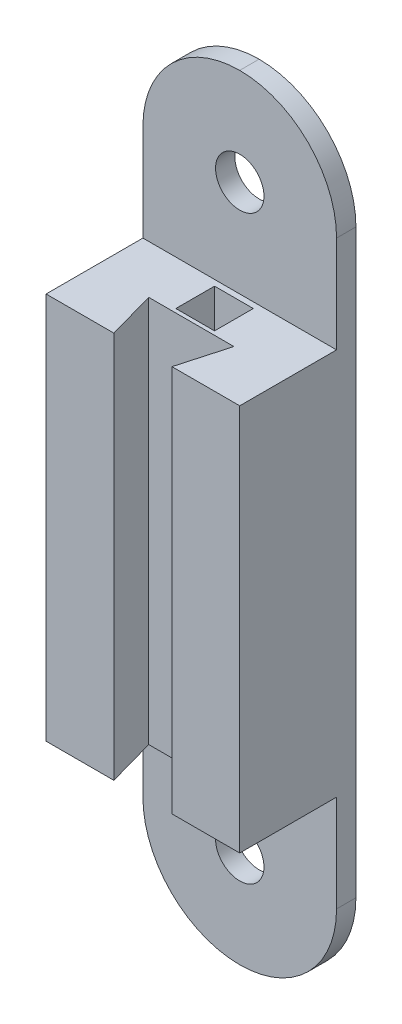
ISO-10303-21;
HEADER;
FILE_DESCRIPTION(('STEP AP214'),'2;1');
FILE_NAME('part.step','',(''),(''),'','','');
FILE_SCHEMA(('AUTOMOTIVE_DESIGN { 1 0 10303 214 1 1 1 1 }'));
ENDSEC;
DATA;
#1=APPLICATION_CONTEXT('core data for automotive mechanical design processes');
#2=APPLICATION_PROTOCOL_DEFINITION('international standard','automotive_design',2000,#1);
#3=PRODUCT_CONTEXT('',#1,'mechanical');
#4=PRODUCT('Part','Part','',(#3));
#5=PRODUCT_RELATED_PRODUCT_CATEGORY('part','',(#4));
#6=PRODUCT_DEFINITION_FORMATION('','',#4);
#7=PRODUCT_DEFINITION_CONTEXT('part definition',#1,'design');
#8=PRODUCT_DEFINITION('design','',#6,#7);
#9=PRODUCT_DEFINITION_SHAPE('','',#8);
#10=(LENGTH_UNIT() NAMED_UNIT(*) SI_UNIT(.MILLI.,.METRE.));
#11=(NAMED_UNIT(*) PLANE_ANGLE_UNIT() SI_UNIT($,.RADIAN.));
#12=(NAMED_UNIT(*) SI_UNIT($,.STERADIAN.) SOLID_ANGLE_UNIT());
#13=UNCERTAINTY_MEASURE_WITH_UNIT(LENGTH_MEASURE(1.E-05),#10,'distance_accuracy_value','');
#14=(GEOMETRIC_REPRESENTATION_CONTEXT(3) GLOBAL_UNCERTAINTY_ASSIGNED_CONTEXT((#13)) GLOBAL_UNIT_ASSIGNED_CONTEXT((#10,
#11,#12)) REPRESENTATION_CONTEXT('',''));
#15=CARTESIAN_POINT('',(0.,0.,0.));
#16=DIRECTION('',(0.,0.,1.));
#17=DIRECTION('',(1.,0.,0.));
#18=AXIS2_PLACEMENT_3D('',#15,#16,#17);
#19=CARTESIAN_POINT('',(0.,-12.7,15.24));
#20=DIRECTION('',(0.,1.,0.));
#21=DIRECTION('',(-1.,0.,0.));
#22=AXIS2_PLACEMENT_3D('',#19,#20,#21);
#23=PLANE('',#22);
#24=DIRECTION('',(-0.269629925519971,0.,0.962964019714182));
#25=VECTOR('',#24,1.);
#26=CARTESIAN_POINT('',(3.5330118694362,-12.7,16.2292433234421));
#27=LINE('',#26,#25);
#28=CARTESIAN_POINT('',(5.588,-12.7,8.89));
#29=VERTEX_POINT('',#28);
#30=CARTESIAN_POINT('',(3.81,-12.7,15.24));
#31=VERTEX_POINT('',#30);
#32=EDGE_CURVE('E241',#29,#31,#27,.T.);
#33=ORIENTED_EDGE('',*,*,#32,.F.);
#34=DIRECTION('',(1.,0.,0.));
#35=VECTOR('',#34,1.);
#36=CARTESIAN_POINT('',(0.,-12.7,8.89));
#37=LINE('',#36,#35);
#38=CARTESIAN_POINT('',(-5.588,-12.7,8.89));
#39=VERTEX_POINT('',#38);
#40=EDGE_CURVE('E244',#39,#29,#37,.T.);
#41=ORIENTED_EDGE('',*,*,#40,.F.);
#42=DIRECTION('',(-0.269629925519971,0.,-0.962964019714182));
#43=VECTOR('',#42,1.);
#44=CARTESIAN_POINT('',(-3.5330118694362,-12.7,16.2292433234421));
#45=LINE('',#44,#43);
#46=CARTESIAN_POINT('',(-3.81,-12.7,15.24));
#47=VERTEX_POINT('',#46);
#48=EDGE_CURVE('E236',#47,#39,#45,.T.);
#49=ORIENTED_EDGE('',*,*,#48,.F.);
#50=DIRECTION('',(1.,0.,0.));
#51=VECTOR('',#50,1.);
#52=CARTESIAN_POINT('',(0.,-12.7,15.24));
#53=LINE('',#52,#51);
#54=CARTESIAN_POINT('',(-12.7,-12.7,15.24));
#55=VERTEX_POINT('',#54);
#56=EDGE_CURVE('E252',#55,#47,#53,.T.);
#57=ORIENTED_EDGE('',*,*,#56,.F.);
#58=DIRECTION('',(0.,0.,-1.));
#59=VECTOR('',#58,1.);
#60=CARTESIAN_POINT('',(-12.7,-12.7,15.24));
#61=LINE('',#60,#59);
#62=CARTESIAN_POINT('',(-12.7,-12.7,2.54));
#63=VERTEX_POINT('',#62);
#64=EDGE_CURVE('E277',#55,#63,#61,.T.);
#65=ORIENTED_EDGE('',*,*,#64,.T.);
#66=DIRECTION('',(-1.,0.,0.));
#67=VECTOR('',#66,1.);
#68=CARTESIAN_POINT('',(0.,-12.7,2.54));
#69=LINE('',#68,#67);
#70=CARTESIAN_POINT('',(12.7,-12.7,2.54));
#71=VERTEX_POINT('',#70);
#72=EDGE_CURVE('E285',#71,#63,#69,.T.);
#73=ORIENTED_EDGE('',*,*,#72,.F.);
#74=DIRECTION('',(0.,0.,-1.));
#75=VECTOR('',#74,1.);
#76=CARTESIAN_POINT('',(12.7,-12.7,15.24));
#77=LINE('',#76,#75);
#78=CARTESIAN_POINT('',(12.7,-12.7,15.24));
#79=VERTEX_POINT('',#78);
#80=EDGE_CURVE('E273',#79,#71,#77,.T.);
#81=ORIENTED_EDGE('',*,*,#80,.F.);
#82=EDGE_CURVE('E251',#31,#79,#53,.T.);
#83=ORIENTED_EDGE('',*,*,#82,.F.);
#84=EDGE_LOOP('',(#33,#41,#49,#57,#65,#73,#81,#83));
#85=FACE_BOUND('',#84,.T.);
#86=ADVANCED_FACE('F43',(#85),#23,.F.);
#87=CARTESIAN_POINT('',(0.,38.1,15.24));
#88=DIRECTION('',(0.,1.,0.));
#89=DIRECTION('',(0.,0.,1.));
#90=AXIS2_PLACEMENT_3D('',#87,#88,#89);
#91=PLANE('',#90);
#92=DIRECTION('',(0.,0.,-1.));
#93=VECTOR('',#92,1.);
#94=CARTESIAN_POINT('',(2.53999999999997,38.1,3.302));
#95=LINE('',#94,#93);
#96=CARTESIAN_POINT('',(2.53999999999997,38.1,8.382));
#97=VERTEX_POINT('',#96);
#98=CARTESIAN_POINT('',(2.53999999999997,38.1,3.302));
#99=VERTEX_POINT('',#98);
#100=EDGE_CURVE('E61',#97,#99,#95,.T.);
#101=ORIENTED_EDGE('',*,*,#100,.F.);
#102=DIRECTION('',(1.,0.,0.));
#103=VECTOR('',#102,1.);
#104=CARTESIAN_POINT('',(-2.54000000000003,38.1,8.382));
#105=LINE('',#104,#103);
#106=CARTESIAN_POINT('',(-2.54000000000003,38.1,8.382));
#107=VERTEX_POINT('',#106);
#108=EDGE_CURVE('E192',#107,#97,#105,.T.);
#109=ORIENTED_EDGE('',*,*,#108,.F.);
#110=DIRECTION('',(0.,0.,1.));
#111=VECTOR('',#110,1.);
#112=CARTESIAN_POINT('',(-2.54000000000003,38.1,3.302));
#113=LINE('',#112,#111);
#114=CARTESIAN_POINT('',(-2.54000000000003,38.1,3.302));
#115=VERTEX_POINT('',#114);
#116=EDGE_CURVE('E196',#115,#107,#113,.T.);
#117=ORIENTED_EDGE('',*,*,#116,.F.);
#118=DIRECTION('',(-1.,0.,0.));
#119=VECTOR('',#118,1.);
#120=CARTESIAN_POINT('',(-2.54000000000003,38.1,3.302));
#121=LINE('',#120,#119);
#122=EDGE_CURVE('E205',#99,#115,#121,.T.);
#123=ORIENTED_EDGE('',*,*,#122,.F.);
#124=EDGE_LOOP('',(#101,#109,#117,#123));
#125=FACE_BOUND('',#124,.T.);
#126=DIRECTION('',(1.,0.,0.));
#127=VECTOR('',#126,1.);
#128=CARTESIAN_POINT('',(0.,38.1,8.89));
#129=LINE('',#128,#127);
#130=CARTESIAN_POINT('',(-5.588,38.1,8.89));
#131=VERTEX_POINT('',#130);
#132=CARTESIAN_POINT('',(5.588,38.1,8.89));
#133=VERTEX_POINT('',#132);
#134=EDGE_CURVE('E223',#131,#133,#129,.T.);
#135=ORIENTED_EDGE('',*,*,#134,.T.);
#136=DIRECTION('',(-0.269629925519971,0.,0.962964019714182));
#137=VECTOR('',#136,1.);
#138=CARTESIAN_POINT('',(7.48998516320475,38.1,2.09719584569733));
#139=LINE('',#138,#137);
#140=CARTESIAN_POINT('',(3.81,38.1,15.24));
#141=VERTEX_POINT('',#140);
#142=EDGE_CURVE('E219',#133,#141,#139,.T.);
#143=ORIENTED_EDGE('',*,*,#142,.T.);
#144=DIRECTION('',(1.,0.,0.));
#145=VECTOR('',#144,1.);
#146=CARTESIAN_POINT('',(0.,38.1,15.24));
#147=LINE('',#146,#145);
#148=CARTESIAN_POINT('',(12.7,38.1,15.24));
#149=VERTEX_POINT('',#148);
#150=EDGE_CURVE('E260',#141,#149,#147,.T.);
#151=ORIENTED_EDGE('',*,*,#150,.T.);
#152=DIRECTION('',(0.,0.,-1.));
#153=VECTOR('',#152,1.);
#154=CARTESIAN_POINT('',(12.7,38.1,15.24));
#155=LINE('',#154,#153);
#156=CARTESIAN_POINT('',(12.7,38.1,2.54));
#157=VERTEX_POINT('',#156);
#158=EDGE_CURVE('E269',#149,#157,#155,.T.);
#159=ORIENTED_EDGE('',*,*,#158,.T.);
#160=DIRECTION('',(-1.,0.,0.));
#161=VECTOR('',#160,1.);
#162=CARTESIAN_POINT('',(0.,38.1,2.54));
#163=LINE('',#162,#161);
#164=CARTESIAN_POINT('',(-12.7,38.1,2.54));
#165=VERTEX_POINT('',#164);
#166=EDGE_CURVE('E281',#157,#165,#163,.T.);
#167=ORIENTED_EDGE('',*,*,#166,.T.);
#168=DIRECTION('',(0.,0.,-1.));
#169=VECTOR('',#168,1.);
#170=CARTESIAN_POINT('',(-12.7,38.1,15.24));
#171=LINE('',#170,#169);
#172=CARTESIAN_POINT('',(-12.7,38.1,15.24));
#173=VERTEX_POINT('',#172);
#174=EDGE_CURVE('E265',#173,#165,#171,.T.);
#175=ORIENTED_EDGE('',*,*,#174,.F.);
#176=CARTESIAN_POINT('',(-3.81,38.1,15.24));
#177=VERTEX_POINT('',#176);
#178=EDGE_CURVE('E261',#173,#177,#147,.T.);
#179=ORIENTED_EDGE('',*,*,#178,.T.);
#180=DIRECTION('',(-0.269629925519971,0.,-0.962964019714182));
#181=VECTOR('',#180,1.);
#182=CARTESIAN_POINT('',(-7.48998516320475,38.1,2.09719584569733));
#183=LINE('',#182,#181);
#184=EDGE_CURVE('E228',#177,#131,#183,.T.);
#185=ORIENTED_EDGE('',*,*,#184,.T.);
#186=EDGE_LOOP('',(#135,#143,#151,#159,#167,#175,#179,#185));
#187=FACE_BOUND('',#186,.T.);
#188=ADVANCED_FACE('F387',(#125,#187),#91,.T.);
#189=CARTESIAN_POINT('',(0.,0.,15.24));
#190=DIRECTION('',(0.,0.,1.));
#191=DIRECTION('',(1.,0.,0.));
#192=AXIS2_PLACEMENT_3D('',#189,#190,#191);
#193=PLANE('',#192);
#194=ORIENTED_EDGE('',*,*,#150,.F.);
#195=DIRECTION('',(0.,-1.,0.));
#196=VECTOR('',#195,1.);
#197=CARTESIAN_POINT('',(3.81,0.,15.24));
#198=LINE('',#197,#196);
#199=EDGE_CURVE('E324',#141,#31,#198,.T.);
#200=ORIENTED_EDGE('',*,*,#199,.T.);
#201=ORIENTED_EDGE('',*,*,#82,.T.);
#202=DIRECTION('',(0.,-1.,0.));
#203=VECTOR('',#202,1.);
#204=CARTESIAN_POINT('',(12.7,0.,15.24));
#205=LINE('',#204,#203);
#206=EDGE_CURVE('E256',#149,#79,#205,.T.);
#207=ORIENTED_EDGE('',*,*,#206,.F.);
#208=EDGE_LOOP('',(#194,#200,#201,#207));
#209=FACE_BOUND('',#208,.T.);
#210=ADVANCED_FACE('F416',(#209),#193,.T.);
#211=ORIENTED_EDGE('',*,*,#56,.T.);
#212=DIRECTION('',(0.,1.,0.));
#213=VECTOR('',#212,1.);
#214=CARTESIAN_POINT('',(-3.81,0.,15.24));
#215=LINE('',#214,#213);
#216=EDGE_CURVE('E306',#47,#177,#215,.T.);
#217=ORIENTED_EDGE('',*,*,#216,.T.);
#218=ORIENTED_EDGE('',*,*,#178,.F.);
#219=DIRECTION('',(0.,-1.,0.));
#220=VECTOR('',#219,1.);
#221=CARTESIAN_POINT('',(-12.7,0.,15.24));
#222=LINE('',#221,#220);
#223=EDGE_CURVE('E247',#173,#55,#222,.T.);
#224=ORIENTED_EDGE('',*,*,#223,.T.);
#225=EDGE_LOOP('',(#211,#217,#218,#224));
#226=FACE_BOUND('',#225,.T.);
#227=ADVANCED_FACE('F612',(#226),#193,.T.);
#228=CARTESIAN_POINT('',(0.,0.,2.54));
#229=DIRECTION('',(0.,0.,1.));
#230=DIRECTION('',(1.,0.,0.));
#231=AXIS2_PLACEMENT_3D('',#228,#229,#230);
#232=PLANE('',#231);
#233=CARTESIAN_POINT('',(0.,-25.4,2.54));
#234=DIRECTION('',(0.,0.,1.));
#235=DIRECTION('',(1.,0.,0.));
#236=AXIS2_PLACEMENT_3D('',#233,#234,#235);
#237=CIRCLE('',#236,3.175);
#238=CARTESIAN_POINT('',(3.175,-25.4,2.54));
#239=VERTEX_POINT('',#238);
#240=EDGE_CURVE('E302',#239,#239,#237,.T.);
#241=ORIENTED_EDGE('',*,*,#240,.F.);
#242=EDGE_LOOP('',(#241));
#243=FACE_BOUND('',#242,.T.);
#244=CARTESIAN_POINT('',(0.,-25.4,2.54));
#245=DIRECTION('',(0.,0.,1.));
#246=DIRECTION('',(1.,0.,0.));
#247=AXIS2_PLACEMENT_3D('',#244,#245,#246);
#248=CIRCLE('',#247,12.7);
#249=CARTESIAN_POINT('',(-12.7,-25.4,2.54));
#250=VERTEX_POINT('',#249);
#251=CARTESIAN_POINT('',(0.,-38.1,2.54));
#252=VERTEX_POINT('',#251);
#253=EDGE_CURVE('E348',#250,#252,#248,.T.);
#254=ORIENTED_EDGE('',*,*,#253,.T.);
#255=CARTESIAN_POINT('',(0.,-25.4,2.54));
#256=DIRECTION('',(0.,0.,1.));
#257=DIRECTION('',(1.,0.,0.));
#258=AXIS2_PLACEMENT_3D('',#255,#256,#257);
#259=CIRCLE('',#258,12.7);
#260=CARTESIAN_POINT('',(12.7,-25.4,2.54));
#261=VERTEX_POINT('',#260);
#262=EDGE_CURVE('E351',#252,#261,#259,.T.);
#263=ORIENTED_EDGE('',*,*,#262,.T.);
#264=DIRECTION('',(0.,-1.,0.));
#265=VECTOR('',#264,1.);
#266=CARTESIAN_POINT('',(12.7,0.,2.54));
#267=LINE('',#266,#265);
#268=EDGE_CURVE('E293',#71,#261,#267,.T.);
#269=ORIENTED_EDGE('',*,*,#268,.F.);
#270=ORIENTED_EDGE('',*,*,#72,.T.);
#271=DIRECTION('',(0.,-1.,0.));
#272=VECTOR('',#271,1.);
#273=CARTESIAN_POINT('',(-12.7,0.,2.54));
#274=LINE('',#273,#272);
#275=EDGE_CURVE('E298',#63,#250,#274,.T.);
#276=ORIENTED_EDGE('',*,*,#275,.T.);
#277=EDGE_LOOP('',(#254,#263,#269,#270,#276));
#278=FACE_BOUND('',#277,.T.);
#279=ADVANCED_FACE('F406',(#243,#278),#232,.T.);
#280=CARTESIAN_POINT('',(12.7,0.,2.54));
#281=DIRECTION('',(1.,0.,0.));
#282=DIRECTION('',(0.,1.,0.));
#283=AXIS2_PLACEMENT_3D('',#280,#281,#282);
#284=PLANE('',#283);
#285=ORIENTED_EDGE('',*,*,#268,.T.);
#286=DIRECTION('',(0.,0.,-1.));
#287=VECTOR('',#286,1.);
#288=CARTESIAN_POINT('',(12.7,-25.4,0.));
#289=LINE('',#288,#287);
#290=CARTESIAN_POINT('',(12.7,-25.4,0.));
#291=VERTEX_POINT('',#290);
#292=EDGE_CURVE('E332',#261,#291,#289,.T.);
#293=ORIENTED_EDGE('',*,*,#292,.T.);
#294=DIRECTION('',(0.,-1.,0.));
#295=VECTOR('',#294,1.);
#296=CARTESIAN_POINT('',(12.7,0.,0.));
#297=LINE('',#296,#295);
#298=CARTESIAN_POINT('',(12.7,50.8,0.));
#299=VERTEX_POINT('',#298);
#300=EDGE_CURVE('E310',#299,#291,#297,.T.);
#301=ORIENTED_EDGE('',*,*,#300,.F.);
#302=DIRECTION('',(0.,0.,-1.));
#303=VECTOR('',#302,1.);
#304=CARTESIAN_POINT('',(12.7,50.8,2.54));
#305=LINE('',#304,#303);
#306=CARTESIAN_POINT('',(12.7,50.8,2.54));
#307=VERTEX_POINT('',#306);
#308=EDGE_CURVE('E328',#299,#307,#305,.F.);
#309=ORIENTED_EDGE('',*,*,#308,.T.);
#310=EDGE_CURVE('E295',#307,#157,#267,.T.);
#311=ORIENTED_EDGE('',*,*,#310,.T.);
#312=ORIENTED_EDGE('',*,*,#158,.F.);
#313=ORIENTED_EDGE('',*,*,#206,.T.);
#314=ORIENTED_EDGE('',*,*,#80,.T.);
#315=EDGE_LOOP('',(#285,#293,#301,#309,#311,#312,#313,#314));
#316=FACE_BOUND('',#315,.T.);
#317=ADVANCED_FACE('F391',(#316),#284,.T.);
#318=CARTESIAN_POINT('',(-12.7,0.,2.54));
#319=DIRECTION('',(1.,0.,0.));
#320=DIRECTION('',(0.,1.,0.));
#321=AXIS2_PLACEMENT_3D('',#318,#319,#320);
#322=PLANE('',#321);
#323=DIRECTION('',(0.,-1.,0.));
#324=VECTOR('',#323,1.);
#325=CARTESIAN_POINT('',(-12.7,0.,0.));
#326=LINE('',#325,#324);
#327=CARTESIAN_POINT('',(-12.7,50.8,0.));
#328=VERTEX_POINT('',#327);
#329=CARTESIAN_POINT('',(-12.7,-25.4,0.));
#330=VERTEX_POINT('',#329);
#331=EDGE_CURVE('E314',#328,#330,#326,.T.);
#332=ORIENTED_EDGE('',*,*,#331,.T.);
#333=DIRECTION('',(0.,0.,-1.));
#334=VECTOR('',#333,1.);
#335=CARTESIAN_POINT('',(-12.7,-25.4,2.54));
#336=LINE('',#335,#334);
#337=EDGE_CURVE('E357',#330,#250,#336,.F.);
#338=ORIENTED_EDGE('',*,*,#337,.T.);
#339=ORIENTED_EDGE('',*,*,#275,.F.);
#340=ORIENTED_EDGE('',*,*,#64,.F.);
#341=ORIENTED_EDGE('',*,*,#223,.F.);
#342=ORIENTED_EDGE('',*,*,#174,.T.);
#343=CARTESIAN_POINT('',(-12.7,50.8,2.54));
#344=VERTEX_POINT('',#343);
#345=EDGE_CURVE('E299',#344,#165,#274,.T.);
#346=ORIENTED_EDGE('',*,*,#345,.F.);
#347=DIRECTION('',(0.,0.,-1.));
#348=VECTOR('',#347,1.);
#349=CARTESIAN_POINT('',(-12.7,50.8,0.));
#350=LINE('',#349,#348);
#351=EDGE_CURVE('E354',#344,#328,#350,.T.);
#352=ORIENTED_EDGE('',*,*,#351,.T.);
#353=EDGE_LOOP('',(#332,#338,#339,#340,#341,#342,#346,#352));
#354=FACE_BOUND('',#353,.T.);
#355=ADVANCED_FACE('F381',(#354),#322,.F.);
#356=CARTESIAN_POINT('',(0.,50.8,2.54));
#357=DIRECTION('',(0.,0.,-1.));
#358=DIRECTION('',(-1.,0.,0.));
#359=AXIS2_PLACEMENT_3D('',#356,#357,#358);
#360=CYLINDRICAL_SURFACE('',#359,3.175);
#361=CARTESIAN_POINT('',(0.,50.8,2.54));
#362=DIRECTION('',(0.,0.,1.));
#363=DIRECTION('',(1.,0.,0.));
#364=AXIS2_PLACEMENT_3D('',#361,#362,#363);
#365=CIRCLE('',#364,3.175);
#366=CARTESIAN_POINT('',(3.175,50.8,2.54));
#367=VERTEX_POINT('',#366);
#368=EDGE_CURVE('E289',#367,#367,#365,.T.);
#369=ORIENTED_EDGE('',*,*,#368,.T.);
#370=EDGE_LOOP('',(#369));
#371=FACE_BOUND('',#370,.T.);
#372=CARTESIAN_POINT('',(0.,50.8,0.));
#373=DIRECTION('',(0.,0.,1.));
#374=DIRECTION('',(1.,0.,0.));
#375=AXIS2_PLACEMENT_3D('',#372,#373,#374);
#376=CIRCLE('',#375,3.175);
#377=CARTESIAN_POINT('',(3.175,50.8,0.));
#378=VERTEX_POINT('',#377);
#379=EDGE_CURVE('E288',#378,#378,#376,.T.);
#380=ORIENTED_EDGE('',*,*,#379,.F.);
#381=EDGE_LOOP('',(#380));
#382=FACE_BOUND('',#381,.T.);
#383=ADVANCED_FACE('F447',(#371,#382),#360,.F.);
#384=CARTESIAN_POINT('',(0.,-25.4,2.54));
#385=DIRECTION('',(0.,0.,-1.));
#386=DIRECTION('',(-1.,0.,0.));
#387=AXIS2_PLACEMENT_3D('',#384,#385,#386);
#388=CYLINDRICAL_SURFACE('',#387,3.175);
#389=ORIENTED_EDGE('',*,*,#240,.T.);
#390=EDGE_LOOP('',(#389));
#391=FACE_BOUND('',#390,.T.);
#392=CARTESIAN_POINT('',(0.,-25.4,0.));
#393=DIRECTION('',(0.,0.,1.));
#394=DIRECTION('',(1.,0.,0.));
#395=AXIS2_PLACEMENT_3D('',#392,#393,#394);
#396=CIRCLE('',#395,3.175);
#397=CARTESIAN_POINT('',(3.175,-25.4,0.));
#398=VERTEX_POINT('',#397);
#399=EDGE_CURVE('E294',#398,#398,#396,.T.);
#400=ORIENTED_EDGE('',*,*,#399,.F.);
#401=EDGE_LOOP('',(#400));
#402=FACE_BOUND('',#401,.T.);
#403=ADVANCED_FACE('F440',(#391,#402),#388,.F.);
#404=ORIENTED_EDGE('',*,*,#310,.F.);
#405=CARTESIAN_POINT('',(0.,50.8,2.54));
#406=DIRECTION('',(0.,0.,1.));
#407=DIRECTION('',(1.,0.,0.));
#408=AXIS2_PLACEMENT_3D('',#405,#406,#407);
#409=CIRCLE('',#408,12.7);
#410=CARTESIAN_POINT('',(0.,63.5,2.54));
#411=VERTEX_POINT('',#410);
#412=EDGE_CURVE('E11',#307,#411,#409,.T.);
#413=ORIENTED_EDGE('',*,*,#412,.T.);
#414=CARTESIAN_POINT('',(0.,50.8,2.54));
#415=DIRECTION('',(0.,0.,1.));
#416=DIRECTION('',(1.,0.,0.));
#417=AXIS2_PLACEMENT_3D('',#414,#415,#416);
#418=CIRCLE('',#417,12.7);
#419=EDGE_CURVE('E53',#411,#344,#418,.T.);
#420=ORIENTED_EDGE('',*,*,#419,.T.);
#421=ORIENTED_EDGE('',*,*,#345,.T.);
#422=ORIENTED_EDGE('',*,*,#166,.F.);
#423=EDGE_LOOP('',(#404,#413,#420,#421,#422));
#424=FACE_BOUND('',#423,.T.);
#425=ORIENTED_EDGE('',*,*,#368,.F.);
#426=EDGE_LOOP('',(#425));
#427=FACE_BOUND('',#426,.T.);
#428=ADVANCED_FACE('F377',(#424,#427),#232,.T.);
#429=CARTESIAN_POINT('',(0.,0.,0.));
#430=DIRECTION('',(0.,0.,1.));
#431=DIRECTION('',(1.,0.,0.));
#432=AXIS2_PLACEMENT_3D('',#429,#430,#431);
#433=PLANE('',#432);
#434=ORIENTED_EDGE('',*,*,#379,.T.);
#435=EDGE_LOOP('',(#434));
#436=FACE_BOUND('',#435,.T.);
#437=ORIENTED_EDGE('',*,*,#300,.T.);
#438=CARTESIAN_POINT('',(0.,-25.4,0.));
#439=DIRECTION('',(0.,0.,1.));
#440=DIRECTION('',(1.,0.,0.));
#441=AXIS2_PLACEMENT_3D('',#438,#439,#440);
#442=CIRCLE('',#441,12.7);
#443=CARTESIAN_POINT('',(0.,-38.1,0.));
#444=VERTEX_POINT('',#443);
#445=EDGE_CURVE('E345',#291,#444,#442,.F.);
#446=ORIENTED_EDGE('',*,*,#445,.T.);
#447=CARTESIAN_POINT('',(0.,-25.4,0.));
#448=DIRECTION('',(0.,0.,1.));
#449=DIRECTION('',(1.,0.,0.));
#450=AXIS2_PLACEMENT_3D('',#447,#448,#449);
#451=CIRCLE('',#450,12.7);
#452=EDGE_CURVE('E342',#444,#330,#451,.F.);
#453=ORIENTED_EDGE('',*,*,#452,.T.);
#454=ORIENTED_EDGE('',*,*,#331,.F.);
#455=CARTESIAN_POINT('',(0.,50.8,0.));
#456=DIRECTION('',(0.,0.,1.));
#457=DIRECTION('',(1.,0.,0.));
#458=AXIS2_PLACEMENT_3D('',#455,#456,#457);
#459=CIRCLE('',#458,12.7);
#460=CARTESIAN_POINT('',(0.,63.5,0.));
#461=VERTEX_POINT('',#460);
#462=EDGE_CURVE('E336',#328,#461,#459,.F.);
#463=ORIENTED_EDGE('',*,*,#462,.T.);
#464=CARTESIAN_POINT('',(0.,50.8,0.));
#465=DIRECTION('',(0.,0.,1.));
#466=DIRECTION('',(1.,0.,0.));
#467=AXIS2_PLACEMENT_3D('',#464,#465,#466);
#468=CIRCLE('',#467,12.7);
#469=EDGE_CURVE('E339',#461,#299,#468,.F.);
#470=ORIENTED_EDGE('',*,*,#469,.T.);
#471=EDGE_LOOP('',(#437,#446,#453,#454,#463,#470));
#472=FACE_BOUND('',#471,.T.);
#473=ORIENTED_EDGE('',*,*,#399,.T.);
#474=EDGE_LOOP('',(#473));
#475=FACE_BOUND('',#474,.T.);
#476=ADVANCED_FACE('F396',(#436,#472,#475),#433,.F.);
#477=CARTESIAN_POINT('',(0.,-38.1,8.89));
#478=DIRECTION('',(0.,0.,1.));
#479=DIRECTION('',(1.,0.,0.));
#480=AXIS2_PLACEMENT_3D('',#477,#478,#479);
#481=PLANE('',#480);
#482=ORIENTED_EDGE('',*,*,#40,.T.);
#483=DIRECTION('',(0.,1.,0.));
#484=VECTOR('',#483,1.);
#485=CARTESIAN_POINT('',(5.588,-38.1,8.89));
#486=LINE('',#485,#484);
#487=EDGE_CURVE('E232',#29,#133,#486,.T.);
#488=ORIENTED_EDGE('',*,*,#487,.T.);
#489=ORIENTED_EDGE('',*,*,#134,.F.);
#490=DIRECTION('',(0.,1.,0.));
#491=VECTOR('',#490,1.);
#492=CARTESIAN_POINT('',(-5.588,-38.1,8.89));
#493=LINE('',#492,#491);
#494=EDGE_CURVE('E233',#39,#131,#493,.T.);
#495=ORIENTED_EDGE('',*,*,#494,.F.);
#496=EDGE_LOOP('',(#482,#488,#489,#495));
#497=FACE_BOUND('',#496,.T.);
#498=ADVANCED_FACE('F443',(#497),#481,.T.);
#499=CARTESIAN_POINT('',(7.48998516320475,-38.1,2.09719584569733));
#500=DIRECTION('',(-0.962964019714182,0.,-0.269629925519971));
#501=DIRECTION('',(-0.269629925519971,0.,0.962964019714182));
#502=AXIS2_PLACEMENT_3D('',#499,#500,#501);
#503=PLANE('',#502);
#504=ORIENTED_EDGE('',*,*,#32,.T.);
#505=ORIENTED_EDGE('',*,*,#199,.F.);
#506=ORIENTED_EDGE('',*,*,#142,.F.);
#507=ORIENTED_EDGE('',*,*,#487,.F.);
#508=EDGE_LOOP('',(#504,#505,#506,#507));
#509=FACE_BOUND('',#508,.T.);
#510=ADVANCED_FACE('F480',(#509),#503,.T.);
#511=CARTESIAN_POINT('',(-7.48998516320475,-38.1,2.09719584569733));
#512=DIRECTION('',(0.962964019714182,0.,-0.269629925519971));
#513=DIRECTION('',(-0.269629925519971,0.,-0.962964019714182));
#514=AXIS2_PLACEMENT_3D('',#511,#512,#513);
#515=PLANE('',#514);
#516=ORIENTED_EDGE('',*,*,#48,.T.);
#517=ORIENTED_EDGE('',*,*,#494,.T.);
#518=ORIENTED_EDGE('',*,*,#184,.F.);
#519=ORIENTED_EDGE('',*,*,#216,.F.);
#520=EDGE_LOOP('',(#516,#517,#518,#519));
#521=FACE_BOUND('',#520,.T.);
#522=ADVANCED_FACE('F426',(#521),#515,.T.);
#523=CARTESIAN_POINT('',(0.,-25.4,2.54));
#524=DIRECTION('',(0.,0.,-1.));
#525=DIRECTION('',(-1.,0.,0.));
#526=AXIS2_PLACEMENT_3D('',#523,#524,#525);
#527=CYLINDRICAL_SURFACE('',#526,12.7);
#528=DIRECTION('',(0.,0.,-1.));
#529=VECTOR('',#528,1.);
#530=CARTESIAN_POINT('',(0.,-38.1,2.54));
#531=LINE('',#530,#529);
#532=EDGE_CURVE('E224',#252,#444,#531,.T.);
#533=ORIENTED_EDGE('',*,*,#532,.F.);
#534=ORIENTED_EDGE('',*,*,#253,.F.);
#535=ORIENTED_EDGE('',*,*,#337,.F.);
#536=ORIENTED_EDGE('',*,*,#452,.F.);
#537=EDGE_LOOP('',(#533,#534,#535,#536));
#538=FACE_BOUND('',#537,.T.);
#539=ADVANCED_FACE('F404',(#538),#527,.T.);
#540=CARTESIAN_POINT('',(0.,-25.4,2.54));
#541=DIRECTION('',(0.,0.,1.));
#542=DIRECTION('',(1.,0.,0.));
#543=AXIS2_PLACEMENT_3D('',#540,#541,#542);
#544=CYLINDRICAL_SURFACE('',#543,12.7);
#545=ORIENTED_EDGE('',*,*,#262,.F.);
#546=ORIENTED_EDGE('',*,*,#532,.T.);
#547=ORIENTED_EDGE('',*,*,#445,.F.);
#548=ORIENTED_EDGE('',*,*,#292,.F.);
#549=EDGE_LOOP('',(#545,#546,#547,#548));
#550=FACE_BOUND('',#549,.T.);
#551=ADVANCED_FACE('F419',(#550),#544,.T.);
#552=CARTESIAN_POINT('',(0.,50.8,2.54));
#553=DIRECTION('',(0.,0.,1.));
#554=DIRECTION('',(1.,0.,0.));
#555=AXIS2_PLACEMENT_3D('',#552,#553,#554);
#556=CYLINDRICAL_SURFACE('',#555,12.7);
#557=ORIENTED_EDGE('',*,*,#351,.F.);
#558=ORIENTED_EDGE('',*,*,#419,.F.);
#559=DIRECTION('',(0.,0.,-1.));
#560=VECTOR('',#559,1.);
#561=CARTESIAN_POINT('',(0.,63.5,2.54));
#562=LINE('',#561,#560);
#563=EDGE_CURVE('E47',#461,#411,#562,.F.);
#564=ORIENTED_EDGE('',*,*,#563,.F.);
#565=ORIENTED_EDGE('',*,*,#462,.F.);
#566=EDGE_LOOP('',(#557,#558,#564,#565));
#567=FACE_BOUND('',#566,.T.);
#568=ADVANCED_FACE('F45',(#567),#556,.T.);
#569=CARTESIAN_POINT('',(0.,50.8,2.54));
#570=DIRECTION('',(0.,0.,-1.));
#571=DIRECTION('',(-1.,0.,0.));
#572=AXIS2_PLACEMENT_3D('',#569,#570,#571);
#573=CYLINDRICAL_SURFACE('',#572,12.7);
#574=ORIENTED_EDGE('',*,*,#412,.F.);
#575=ORIENTED_EDGE('',*,*,#308,.F.);
#576=ORIENTED_EDGE('',*,*,#469,.F.);
#577=ORIENTED_EDGE('',*,*,#563,.T.);
#578=EDGE_LOOP('',(#574,#575,#576,#577));
#579=FACE_BOUND('',#578,.T.);
#580=ADVANCED_FACE('F371',(#579),#573,.T.);
#581=CARTESIAN_POINT('',(2.53999999999997,17.78,3.302));
#582=DIRECTION('',(1.,0.,0.));
#583=DIRECTION('',(0.,0.,-1.));
#584=AXIS2_PLACEMENT_3D('',#581,#582,#583);
#585=PLANE('',#584);
#586=ORIENTED_EDGE('',*,*,#100,.T.);
#587=DIRECTION('',(0.,1.,0.));
#588=VECTOR('',#587,1.);
#589=CARTESIAN_POINT('',(2.53999999999997,17.78,3.302));
#590=LINE('',#589,#588);
#591=CARTESIAN_POINT('',(2.53999999999997,17.78,3.302));
#592=VERTEX_POINT('',#591);
#593=EDGE_CURVE('E167',#592,#99,#590,.T.);
#594=ORIENTED_EDGE('',*,*,#593,.F.);
#595=DIRECTION('',(0.,0.,-1.));
#596=VECTOR('',#595,1.);
#597=CARTESIAN_POINT('',(2.53999999999997,17.78,3.302));
#598=LINE('',#597,#596);
#599=CARTESIAN_POINT('',(2.53999999999997,17.78,8.382));
#600=VERTEX_POINT('',#599);
#601=EDGE_CURVE('E171',#600,#592,#598,.T.);
#602=ORIENTED_EDGE('',*,*,#601,.F.);
#603=DIRECTION('',(0.,1.,0.));
#604=VECTOR('',#603,1.);
#605=CARTESIAN_POINT('',(2.53999999999997,17.78,8.382));
#606=LINE('',#605,#604);
#607=EDGE_CURVE('E211',#600,#97,#606,.T.);
#608=ORIENTED_EDGE('',*,*,#607,.T.);
#609=EDGE_LOOP('',(#586,#594,#602,#608));
#610=FACE_BOUND('',#609,.T.);
#611=ADVANCED_FACE('F169',(#610),#585,.F.);
#612=CARTESIAN_POINT('',(-2.54000000000003,17.78,8.382));
#613=DIRECTION('',(0.,0.,1.));
#614=DIRECTION('',(1.,0.,0.));
#615=AXIS2_PLACEMENT_3D('',#612,#613,#614);
#616=PLANE('',#615);
#617=ORIENTED_EDGE('',*,*,#108,.T.);
#618=ORIENTED_EDGE('',*,*,#607,.F.);
#619=DIRECTION('',(1.,0.,0.));
#620=VECTOR('',#619,1.);
#621=CARTESIAN_POINT('',(-2.54000000000003,17.78,8.382));
#622=LINE('',#621,#620);
#623=CARTESIAN_POINT('',(-2.54000000000003,17.78,8.382));
#624=VERTEX_POINT('',#623);
#625=EDGE_CURVE('E178',#624,#600,#622,.T.);
#626=ORIENTED_EDGE('',*,*,#625,.F.);
#627=DIRECTION('',(0.,1.,0.));
#628=VECTOR('',#627,1.);
#629=CARTESIAN_POINT('',(-2.54000000000003,17.78,8.382));
#630=LINE('',#629,#628);
#631=EDGE_CURVE('E214',#624,#107,#630,.T.);
#632=ORIENTED_EDGE('',*,*,#631,.T.);
#633=EDGE_LOOP('',(#617,#618,#626,#632));
#634=FACE_BOUND('',#633,.T.);
#635=ADVANCED_FACE('F540',(#634),#616,.F.);
#636=CARTESIAN_POINT('',(-2.54000000000003,17.78,3.302));
#637=DIRECTION('',(-1.,0.,0.));
#638=DIRECTION('',(0.,0.,1.));
#639=AXIS2_PLACEMENT_3D('',#636,#637,#638);
#640=PLANE('',#639);
#641=ORIENTED_EDGE('',*,*,#116,.T.);
#642=ORIENTED_EDGE('',*,*,#631,.F.);
#643=DIRECTION('',(0.,0.,1.));
#644=VECTOR('',#643,1.);
#645=CARTESIAN_POINT('',(-2.54000000000003,17.78,3.302));
#646=LINE('',#645,#644);
#647=CARTESIAN_POINT('',(-2.54000000000003,17.78,3.302));
#648=VERTEX_POINT('',#647);
#649=EDGE_CURVE('E187',#648,#624,#646,.T.);
#650=ORIENTED_EDGE('',*,*,#649,.F.);
#651=DIRECTION('',(0.,1.,0.));
#652=VECTOR('',#651,1.);
#653=CARTESIAN_POINT('',(-2.54000000000003,17.78,3.302));
#654=LINE('',#653,#652);
#655=EDGE_CURVE('E177',#648,#115,#654,.T.);
#656=ORIENTED_EDGE('',*,*,#655,.T.);
#657=EDGE_LOOP('',(#641,#642,#650,#656));
#658=FACE_BOUND('',#657,.T.);
#659=ADVANCED_FACE('F550',(#658),#640,.F.);
#660=CARTESIAN_POINT('',(-2.54000000000003,17.78,3.302));
#661=DIRECTION('',(0.,0.,-1.));
#662=DIRECTION('',(-1.,0.,0.));
#663=AXIS2_PLACEMENT_3D('',#660,#661,#662);
#664=PLANE('',#663);
#665=ORIENTED_EDGE('',*,*,#122,.T.);
#666=ORIENTED_EDGE('',*,*,#655,.F.);
#667=DIRECTION('',(-1.,0.,0.));
#668=VECTOR('',#667,1.);
#669=CARTESIAN_POINT('',(-2.54000000000003,17.78,3.302));
#670=LINE('',#669,#668);
#671=EDGE_CURVE('E181',#592,#648,#670,.T.);
#672=ORIENTED_EDGE('',*,*,#671,.F.);
#673=ORIENTED_EDGE('',*,*,#593,.T.);
#674=EDGE_LOOP('',(#665,#666,#672,#673));
#675=FACE_BOUND('',#674,.T.);
#676=ADVANCED_FACE('F182',(#675),#664,.F.);
#677=CARTESIAN_POINT('',(0.,17.78,0.));
#678=DIRECTION('',(0.,1.,0.));
#679=DIRECTION('',(0.,0.,1.));
#680=AXIS2_PLACEMENT_3D('',#677,#678,#679);
#681=PLANE('',#680);
#682=ORIENTED_EDGE('',*,*,#601,.T.);
#683=ORIENTED_EDGE('',*,*,#671,.T.);
#684=ORIENTED_EDGE('',*,*,#649,.T.);
#685=ORIENTED_EDGE('',*,*,#625,.T.);
#686=EDGE_LOOP('',(#682,#683,#684,#685));
#687=FACE_BOUND('',#686,.T.);
#688=ADVANCED_FACE('F189',(#687),#681,.T.);
#689=CLOSED_SHELL('',(#86,#188,#210,#227,#279,#317,#355,#383,#403,#428,#476,#498,#510,#522,#539,
#551,#568,#580,#611,#635,#659,#676,#688));
#690=MANIFOLD_SOLID_BREP('B2',#689);
#691=ADVANCED_BREP_SHAPE_REPRESENTATION('',(#18,#690),#14);
#692=SHAPE_DEFINITION_REPRESENTATION(#9,#691);
ENDSEC;
END-ISO-10303-21;
